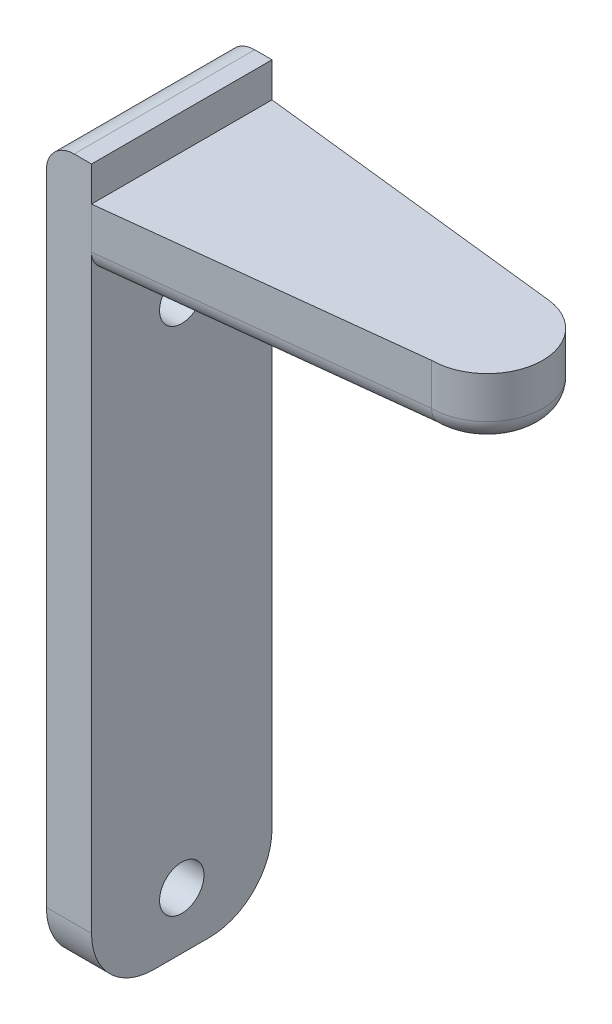
ISO-10303-21;
HEADER;
FILE_DESCRIPTION(('STEP AP214'),'2;1');
FILE_NAME('part.step','',(''),(''),'','','');
FILE_SCHEMA(('AUTOMOTIVE_DESIGN { 1 0 10303 214 1 1 1 1 }'));
ENDSEC;
DATA;
#1=APPLICATION_CONTEXT('core data for automotive mechanical design processes');
#2=APPLICATION_PROTOCOL_DEFINITION('international standard','automotive_design',2000,#1);
#3=PRODUCT_CONTEXT('',#1,'mechanical');
#4=PRODUCT('Part','Part','',(#3));
#5=PRODUCT_RELATED_PRODUCT_CATEGORY('part','',(#4));
#6=PRODUCT_DEFINITION_FORMATION('','',#4);
#7=PRODUCT_DEFINITION_CONTEXT('part definition',#1,'design');
#8=PRODUCT_DEFINITION('design','',#6,#7);
#9=PRODUCT_DEFINITION_SHAPE('','',#8);
#10=(LENGTH_UNIT() NAMED_UNIT(*) SI_UNIT(.MILLI.,.METRE.));
#11=(NAMED_UNIT(*) PLANE_ANGLE_UNIT() SI_UNIT($,.RADIAN.));
#12=(NAMED_UNIT(*) SI_UNIT($,.STERADIAN.) SOLID_ANGLE_UNIT());
#13=UNCERTAINTY_MEASURE_WITH_UNIT(LENGTH_MEASURE(1.E-05),#10,'distance_accuracy_value','');
#14=(GEOMETRIC_REPRESENTATION_CONTEXT(3) GLOBAL_UNCERTAINTY_ASSIGNED_CONTEXT((#13)) GLOBAL_UNIT_ASSIGNED_CONTEXT((#10,
#11,#12)) REPRESENTATION_CONTEXT('',''));
#15=CARTESIAN_POINT('',(0.,0.,0.));
#16=DIRECTION('',(0.,0.,1.));
#17=DIRECTION('',(1.,0.,0.));
#18=AXIS2_PLACEMENT_3D('',#15,#16,#17);
#19=CARTESIAN_POINT('',(0.,0.,13.));
#20=DIRECTION('',(0.,1.,0.));
#21=DIRECTION('',(0.,0.,1.));
#22=AXIS2_PLACEMENT_3D('',#19,#20,#21);
#23=PLANE('',#22);
#24=DIRECTION('',(0.,0.,-1.));
#25=VECTOR('',#24,1.);
#26=CARTESIAN_POINT('',(0.,0.,13.));
#27=LINE('',#26,#25);
#28=CARTESIAN_POINT('',(0.,0.,11.4903461487106));
#29=VERTEX_POINT('',#28);
#30=CARTESIAN_POINT('',(0.,0.,1.50946060186236));
#31=VERTEX_POINT('',#30);
#32=EDGE_CURVE('E203',#29,#31,#27,.T.);
#33=ORIENTED_EDGE('',*,*,#32,.T.);
#34=DIRECTION('',(0.9937324618803,0.,0.11178458840698));
#35=VECTOR('',#34,1.);
#36=CARTESIAN_POINT('',(1.27641478248281,0.,1.65304401748958));
#37=LINE('',#36,#35);
#38=CARTESIAN_POINT('',(22.2794619833277,0.,4.01566884529924));
#39=VERTEX_POINT('',#38);
#40=EDGE_CURVE('E231',#31,#39,#37,.T.);
#41=ORIENTED_EDGE('',*,*,#40,.T.);
#42=CARTESIAN_POINT('',(22.0000005123102,0.,6.5));
#43=DIRECTION('',(0.,1.,0.));
#44=DIRECTION('',(0.,0.,1.));
#45=AXIS2_PLACEMENT_3D('',#42,#43,#44);
#46=CIRCLE('',#45,2.50000000000001);
#47=CARTESIAN_POINT('',(21.9249596445972,0.,8.99887351984308));
#48=VERTEX_POINT('',#47);
#49=EDGE_CURVE('E229',#39,#48,#46,.F.);
#50=ORIENTED_EDGE('',*,*,#49,.T.);
#51=DIRECTION('',(0.993605255084695,0.,-0.112909685448497));
#52=VECTOR('',#51,1.);
#53=CARTESIAN_POINT('',(-0.169364528172745,0.,11.509592117373));
#54=LINE('',#53,#52);
#55=EDGE_CURVE('E227',#48,#29,#54,.F.);
#56=ORIENTED_EDGE('',*,*,#55,.T.);
#57=EDGE_LOOP('',(#33,#41,#50,#56));
#58=FACE_BOUND('',#57,.T.);
#59=ADVANCED_FACE('F33',(#58),#23,.F.);
#60=CARTESIAN_POINT('',(0.,4.5,13.));
#61=DIRECTION('',(0.,-1.,0.));
#62=DIRECTION('',(0.,0.,-1.));
#63=AXIS2_PLACEMENT_3D('',#60,#61,#62);
#64=PLANE('',#63);
#65=DIRECTION('',(0.993605255084695,0.,-0.112909685448497));
#66=VECTOR('',#65,1.);
#67=CARTESIAN_POINT('',(1.45843953855062,4.5,12.834268238115));
#68=LINE('',#67,#66);
#69=CARTESIAN_POINT('',(0.,4.5,13.));
#70=VERTEX_POINT('',#69);
#71=CARTESIAN_POINT('',(22.0000005123102,4.5,10.5));
#72=VERTEX_POINT('',#71);
#73=EDGE_CURVE('E138',#70,#72,#68,.T.);
#74=ORIENTED_EDGE('',*,*,#73,.T.);
#75=CARTESIAN_POINT('',(22.0000005123102,4.5,6.5));
#76=DIRECTION('',(0.,1.,0.));
#77=DIRECTION('',(0.,0.,1.));
#78=AXIS2_PLACEMENT_3D('',#75,#76,#77);
#79=CIRCLE('',#78,4.00000000000001);
#80=CARTESIAN_POINT('',(22.4471388659382,4.5,2.5250701524788));
#81=VERTEX_POINT('',#80);
#82=EDGE_CURVE('E141',#72,#81,#79,.T.);
#83=ORIENTED_EDGE('',*,*,#82,.T.);
#84=DIRECTION('',(0.9937324618803,0.,0.11178458840698));
#85=VECTOR('',#84,1.);
#86=CARTESIAN_POINT('',(0.,4.5,0.));
#87=LINE('',#86,#85);
#88=CARTESIAN_POINT('',(0.,4.5,0.));
#89=VERTEX_POINT('',#88);
#90=EDGE_CURVE('E150',#89,#81,#87,.T.);
#91=ORIENTED_EDGE('',*,*,#90,.F.);
#92=DIRECTION('',(0.,0.,-1.));
#93=VECTOR('',#92,1.);
#94=CARTESIAN_POINT('',(0.,4.5,13.));
#95=LINE('',#94,#93);
#96=EDGE_CURVE('E155',#70,#89,#95,.T.);
#97=ORIENTED_EDGE('',*,*,#96,.F.);
#98=EDGE_LOOP('',(#74,#83,#91,#97));
#99=FACE_BOUND('',#98,.T.);
#100=ADVANCED_FACE('F153',(#99),#64,.F.);
#101=CARTESIAN_POINT('',(-1.25,5.,13.));
#102=DIRECTION('',(0.,0.,-1.));
#103=DIRECTION('',(-1.,0.,0.));
#104=AXIS2_PLACEMENT_3D('',#101,#102,#103);
#105=PLANE('',#104);
#106=DIRECTION('',(0.,-1.,0.));
#107=VECTOR('',#106,1.);
#108=CARTESIAN_POINT('',(0.,5.,13.));
#109=LINE('',#108,#107);
#110=CARTESIAN_POINT('',(0.,1.5,13.));
#111=VERTEX_POINT('',#110);
#112=EDGE_CURVE('E225',#70,#111,#109,.T.);
#113=ORIENTED_EDGE('',*,*,#112,.F.);
#114=DIRECTION('',(0.,1.,0.));
#115=VECTOR('',#114,1.);
#116=CARTESIAN_POINT('',(0.,4.5,13.));
#117=LINE('',#116,#115);
#118=CARTESIAN_POINT('',(0.,7.,13.));
#119=VERTEX_POINT('',#118);
#120=EDGE_CURVE('E168',#70,#119,#117,.T.);
#121=ORIENTED_EDGE('',*,*,#120,.T.);
#122=DIRECTION('',(-1.,0.,0.));
#123=VECTOR('',#122,1.);
#124=CARTESIAN_POINT('',(0.,7.,13.));
#125=LINE('',#124,#123);
#126=CARTESIAN_POINT('',(-1.24999999999999,7.,13.));
#127=VERTEX_POINT('',#126);
#128=EDGE_CURVE('E171',#119,#127,#125,.T.);
#129=ORIENTED_EDGE('',*,*,#128,.T.);
#130=CARTESIAN_POINT('',(-1.25,5.,13.));
#131=DIRECTION('',(0.,0.,1.));
#132=DIRECTION('',(-1.,0.,0.));
#133=AXIS2_PLACEMENT_3D('',#130,#131,#132);
#134=CIRCLE('',#133,2.);
#135=CARTESIAN_POINT('',(-3.25,4.99999999999999,13.));
#136=VERTEX_POINT('',#135);
#137=EDGE_CURVE('E173',#127,#136,#134,.T.);
#138=ORIENTED_EDGE('',*,*,#137,.T.);
#139=DIRECTION('',(0.,-1.,0.));
#140=VECTOR('',#139,1.);
#141=CARTESIAN_POINT('',(-3.25,-45.5,13.));
#142=LINE('',#141,#140);
#143=CARTESIAN_POINT('',(-3.25,-41.,13.));
#144=VERTEX_POINT('',#143);
#145=EDGE_CURVE('E175',#136,#144,#142,.T.);
#146=ORIENTED_EDGE('',*,*,#145,.T.);
#147=DIRECTION('',(1.,0.,0.));
#148=VECTOR('',#147,1.);
#149=CARTESIAN_POINT('',(-1.25,-41.,13.));
#150=LINE('',#149,#148);
#151=CARTESIAN_POINT('',(0.,-41.,13.));
#152=VERTEX_POINT('',#151);
#153=EDGE_CURVE('E206',#144,#152,#150,.T.);
#154=ORIENTED_EDGE('',*,*,#153,.T.);
#155=DIRECTION('',(0.,1.,0.));
#156=VECTOR('',#155,1.);
#157=CARTESIAN_POINT('',(0.,-45.5,13.));
#158=LINE('',#157,#156);
#159=EDGE_CURVE('E55',#152,#111,#158,.T.);
#160=ORIENTED_EDGE('',*,*,#159,.T.);
#161=EDGE_LOOP('',(#113,#121,#129,#138,#146,#154,#160));
#162=FACE_BOUND('',#161,.T.);
#163=ADVANCED_FACE('F283',(#162),#105,.F.);
#164=CARTESIAN_POINT('',(0.,-45.5,13.));
#165=DIRECTION('',(-1.,0.,0.));
#166=DIRECTION('',(0.,0.,1.));
#167=AXIS2_PLACEMENT_3D('',#164,#165,#166);
#168=PLANE('',#167);
#169=CARTESIAN_POINT('',(0.,-4.59999999998963,6.49991314393883));
#170=DIRECTION('',(-1.,0.,0.));
#171=DIRECTION('',(0.,0.,1.));
#172=AXIS2_PLACEMENT_3D('',#169,#170,#171);
#173=CIRCLE('',#172,1.6);
#174=CARTESIAN_POINT('',(0.,-4.59999999998963,4.89991314393883));
#175=VERTEX_POINT('',#174);
#176=EDGE_CURVE('E161',#175,#175,#173,.T.);
#177=ORIENTED_EDGE('',*,*,#176,.T.);
#178=EDGE_LOOP('',(#177));
#179=FACE_BOUND('',#178,.T.);
#180=CARTESIAN_POINT('',(0.,-41.3999999999066,6.49999129315768));
#181=DIRECTION('',(-1.,0.,0.));
#182=DIRECTION('',(0.,0.,1.));
#183=AXIS2_PLACEMENT_3D('',#180,#181,#182);
#184=CIRCLE('',#183,1.6);
#185=CARTESIAN_POINT('',(0.,-41.3999999999066,4.89999129315769));
#186=VERTEX_POINT('',#185);
#187=EDGE_CURVE('E246',#186,#186,#184,.T.);
#188=ORIENTED_EDGE('',*,*,#187,.T.);
#189=EDGE_LOOP('',(#188));
#190=FACE_BOUND('',#189,.T.);
#191=ORIENTED_EDGE('',*,*,#159,.F.);
#192=CARTESIAN_POINT('',(0.,-41.,8.5));
#193=DIRECTION('',(-1.,0.,0.));
#194=DIRECTION('',(0.,0.,1.));
#195=AXIS2_PLACEMENT_3D('',#192,#193,#194);
#196=CIRCLE('',#195,4.5);
#197=CARTESIAN_POINT('',(0.,-45.5,8.5));
#198=VERTEX_POINT('',#197);
#199=EDGE_CURVE('E210',#152,#198,#196,.F.);
#200=ORIENTED_EDGE('',*,*,#199,.T.);
#201=DIRECTION('',(0.,0.,-1.));
#202=VECTOR('',#201,1.);
#203=CARTESIAN_POINT('',(0.,-45.5,13.));
#204=LINE('',#203,#202);
#205=CARTESIAN_POINT('',(0.,-45.5,4.5));
#206=VERTEX_POINT('',#205);
#207=EDGE_CURVE('E178',#198,#206,#204,.T.);
#208=ORIENTED_EDGE('',*,*,#207,.T.);
#209=CARTESIAN_POINT('',(0.,-41.,4.5));
#210=DIRECTION('',(-1.,0.,0.));
#211=DIRECTION('',(0.,0.,1.));
#212=AXIS2_PLACEMENT_3D('',#209,#210,#211);
#213=CIRCLE('',#212,4.5);
#214=CARTESIAN_POINT('',(0.,-41.,0.));
#215=VERTEX_POINT('',#214);
#216=EDGE_CURVE('E208',#206,#215,#213,.F.);
#217=ORIENTED_EDGE('',*,*,#216,.T.);
#218=DIRECTION('',(0.,1.,0.));
#219=VECTOR('',#218,1.);
#220=CARTESIAN_POINT('',(0.,-45.5,0.));
#221=LINE('',#220,#219);
#222=CARTESIAN_POINT('',(0.,1.5,0.));
#223=VERTEX_POINT('',#222);
#224=EDGE_CURVE('E166',#215,#223,#221,.T.);
#225=ORIENTED_EDGE('',*,*,#224,.T.);
#226=CARTESIAN_POINT('',(0.,1.5,1.50946060186235));
#227=DIRECTION('',(-1.,0.,0.));
#228=DIRECTION('',(0.,0.,1.));
#229=AXIS2_PLACEMENT_3D('',#226,#227,#228);
#230=ELLIPSE('',#229,1.50946060186236,1.5);
#231=EDGE_CURVE('E47',#223,#31,#230,.T.);
#232=ORIENTED_EDGE('',*,*,#231,.T.);
#233=ORIENTED_EDGE('',*,*,#32,.F.);
#234=CARTESIAN_POINT('',(0.,1.5,11.4903461487106));
#235=DIRECTION('',(-1.,0.,0.));
#236=DIRECTION('',(0.,0.,1.));
#237=AXIS2_PLACEMENT_3D('',#234,#235,#236);
#238=ELLIPSE('',#237,1.5096538512894,1.5);
#239=EDGE_CURVE('E11',#29,#111,#238,.T.);
#240=ORIENTED_EDGE('',*,*,#239,.T.);
#241=EDGE_LOOP('',(#191,#200,#208,#217,#225,#232,#233,#240));
#242=FACE_BOUND('',#241,.T.);
#243=ADVANCED_FACE('F287',(#179,#190,#242),#168,.F.);
#244=CARTESIAN_POINT('',(0.,4.5,13.));
#245=DIRECTION('',(-1.,0.,0.));
#246=DIRECTION('',(0.,0.,1.));
#247=AXIS2_PLACEMENT_3D('',#244,#245,#246);
#248=PLANE('',#247);
#249=DIRECTION('',(0.,1.,0.));
#250=VECTOR('',#249,1.);
#251=CARTESIAN_POINT('',(0.,4.5,0.));
#252=LINE('',#251,#250);
#253=CARTESIAN_POINT('',(0.,7.,0.));
#254=VERTEX_POINT('',#253);
#255=EDGE_CURVE('E180',#89,#254,#252,.T.);
#256=ORIENTED_EDGE('',*,*,#255,.T.);
#257=DIRECTION('',(0.,0.,-1.));
#258=VECTOR('',#257,1.);
#259=CARTESIAN_POINT('',(0.,7.,13.));
#260=LINE('',#259,#258);
#261=EDGE_CURVE('E199',#119,#254,#260,.T.);
#262=ORIENTED_EDGE('',*,*,#261,.F.);
#263=ORIENTED_EDGE('',*,*,#120,.F.);
#264=ORIENTED_EDGE('',*,*,#96,.T.);
#265=EDGE_LOOP('',(#256,#262,#263,#264));
#266=FACE_BOUND('',#265,.T.);
#267=ADVANCED_FACE('F290',(#266),#248,.F.);
#268=CARTESIAN_POINT('',(0.,7.,13.));
#269=DIRECTION('',(0.,-1.,0.));
#270=DIRECTION('',(0.,0.,-1.));
#271=AXIS2_PLACEMENT_3D('',#268,#269,#270);
#272=PLANE('',#271);
#273=DIRECTION('',(-1.,0.,0.));
#274=VECTOR('',#273,1.);
#275=CARTESIAN_POINT('',(0.,7.,0.));
#276=LINE('',#275,#274);
#277=CARTESIAN_POINT('',(-1.24999999999999,7.,0.));
#278=VERTEX_POINT('',#277);
#279=EDGE_CURVE('E182',#254,#278,#276,.T.);
#280=ORIENTED_EDGE('',*,*,#279,.T.);
#281=DIRECTION('',(0.,0.,-1.));
#282=VECTOR('',#281,1.);
#283=CARTESIAN_POINT('',(-1.24999999999999,7.,13.));
#284=LINE('',#283,#282);
#285=EDGE_CURVE('E196',#127,#278,#284,.T.);
#286=ORIENTED_EDGE('',*,*,#285,.F.);
#287=ORIENTED_EDGE('',*,*,#128,.F.);
#288=ORIENTED_EDGE('',*,*,#261,.T.);
#289=EDGE_LOOP('',(#280,#286,#287,#288));
#290=FACE_BOUND('',#289,.T.);
#291=ADVANCED_FACE('F320',(#290),#272,.F.);
#292=CARTESIAN_POINT('',(-1.25,5.,13.));
#293=DIRECTION('',(0.,0.,-1.));
#294=DIRECTION('',(-1.,0.,0.));
#295=AXIS2_PLACEMENT_3D('',#292,#293,#294);
#296=CYLINDRICAL_SURFACE('',#295,2.);
#297=CARTESIAN_POINT('',(-1.25,5.,0.));
#298=DIRECTION('',(0.,0.,1.));
#299=DIRECTION('',(-1.,0.,0.));
#300=AXIS2_PLACEMENT_3D('',#297,#298,#299);
#301=CIRCLE('',#300,2.);
#302=CARTESIAN_POINT('',(-3.25,4.99999999999999,0.));
#303=VERTEX_POINT('',#302);
#304=EDGE_CURVE('E184',#278,#303,#301,.T.);
#305=ORIENTED_EDGE('',*,*,#304,.T.);
#306=DIRECTION('',(0.,0.,-1.));
#307=VECTOR('',#306,1.);
#308=CARTESIAN_POINT('',(-3.25,4.99999999999999,13.));
#309=LINE('',#308,#307);
#310=EDGE_CURVE('E193',#136,#303,#309,.T.);
#311=ORIENTED_EDGE('',*,*,#310,.F.);
#312=ORIENTED_EDGE('',*,*,#137,.F.);
#313=ORIENTED_EDGE('',*,*,#285,.T.);
#314=EDGE_LOOP('',(#305,#311,#312,#313));
#315=FACE_BOUND('',#314,.T.);
#316=ADVANCED_FACE('F325',(#315),#296,.T.);
#317=CARTESIAN_POINT('',(-3.25,-45.5,13.));
#318=DIRECTION('',(1.,0.,0.));
#319=DIRECTION('',(0.,0.,-1.));
#320=AXIS2_PLACEMENT_3D('',#317,#318,#319);
#321=PLANE('',#320);
#322=CARTESIAN_POINT('',(-3.25,-4.59999999998963,6.49991314393883));
#323=DIRECTION('',(1.,0.,0.));
#324=DIRECTION('',(0.,0.,-1.));
#325=AXIS2_PLACEMENT_3D('',#322,#323,#324);
#326=CIRCLE('',#325,1.6);
#327=CARTESIAN_POINT('',(-3.25,-4.59999999998963,4.89991314393883));
#328=VERTEX_POINT('',#327);
#329=EDGE_CURVE('E250',#328,#328,#326,.T.);
#330=ORIENTED_EDGE('',*,*,#329,.T.);
#331=EDGE_LOOP('',(#330));
#332=FACE_BOUND('',#331,.T.);
#333=CARTESIAN_POINT('',(-3.25,-41.3999999999066,6.49999129315768));
#334=DIRECTION('',(1.,0.,0.));
#335=DIRECTION('',(0.,0.,-1.));
#336=AXIS2_PLACEMENT_3D('',#333,#334,#335);
#337=CIRCLE('',#336,1.6);
#338=CARTESIAN_POINT('',(-3.25,-41.3999999999066,4.89999129315769));
#339=VERTEX_POINT('',#338);
#340=EDGE_CURVE('E254',#339,#339,#337,.T.);
#341=ORIENTED_EDGE('',*,*,#340,.T.);
#342=EDGE_LOOP('',(#341));
#343=FACE_BOUND('',#342,.T.);
#344=DIRECTION('',(0.,0.,-1.));
#345=VECTOR('',#344,1.);
#346=CARTESIAN_POINT('',(-3.25,-45.5,13.));
#347=LINE('',#346,#345);
#348=CARTESIAN_POINT('',(-3.25,-45.5,8.5));
#349=VERTEX_POINT('',#348);
#350=CARTESIAN_POINT('',(-3.25,-45.5,4.5));
#351=VERTEX_POINT('',#350);
#352=EDGE_CURVE('E190',#349,#351,#347,.T.);
#353=ORIENTED_EDGE('',*,*,#352,.F.);
#354=CARTESIAN_POINT('',(-3.25,-41.,8.5));
#355=DIRECTION('',(1.,0.,0.));
#356=DIRECTION('',(0.,0.,-1.));
#357=AXIS2_PLACEMENT_3D('',#354,#355,#356);
#358=CIRCLE('',#357,4.5);
#359=EDGE_CURVE('E219',#349,#144,#358,.F.);
#360=ORIENTED_EDGE('',*,*,#359,.T.);
#361=ORIENTED_EDGE('',*,*,#145,.F.);
#362=ORIENTED_EDGE('',*,*,#310,.T.);
#363=DIRECTION('',(0.,-1.,0.));
#364=VECTOR('',#363,1.);
#365=CARTESIAN_POINT('',(-3.25,-45.5,0.));
#366=LINE('',#365,#364);
#367=CARTESIAN_POINT('',(-3.25,-41.,0.));
#368=VERTEX_POINT('',#367);
#369=EDGE_CURVE('E169',#303,#368,#366,.T.);
#370=ORIENTED_EDGE('',*,*,#369,.T.);
#371=CARTESIAN_POINT('',(-3.25,-41.,4.5));
#372=DIRECTION('',(1.,0.,0.));
#373=DIRECTION('',(0.,0.,-1.));
#374=AXIS2_PLACEMENT_3D('',#371,#372,#373);
#375=CIRCLE('',#374,4.5);
#376=EDGE_CURVE('E217',#368,#351,#375,.F.);
#377=ORIENTED_EDGE('',*,*,#376,.T.);
#378=EDGE_LOOP('',(#353,#360,#361,#362,#370,#377));
#379=FACE_BOUND('',#378,.T.);
#380=ADVANCED_FACE('F260',(#332,#343,#379),#321,.F.);
#381=CARTESIAN_POINT('',(0.,-45.5,13.));
#382=DIRECTION('',(0.,1.,0.));
#383=DIRECTION('',(0.,0.,1.));
#384=AXIS2_PLACEMENT_3D('',#381,#382,#383);
#385=PLANE('',#384);
#386=ORIENTED_EDGE('',*,*,#207,.F.);
#387=DIRECTION('',(1.,0.,0.));
#388=VECTOR('',#387,1.);
#389=CARTESIAN_POINT('',(0.,-45.5,8.5));
#390=LINE('',#389,#388);
#391=EDGE_CURVE('E215',#198,#349,#390,.F.);
#392=ORIENTED_EDGE('',*,*,#391,.T.);
#393=ORIENTED_EDGE('',*,*,#352,.T.);
#394=DIRECTION('',(1.,0.,0.));
#395=VECTOR('',#394,1.);
#396=CARTESIAN_POINT('',(0.,-45.5,4.5));
#397=LINE('',#396,#395);
#398=EDGE_CURVE('E212',#351,#206,#397,.T.);
#399=ORIENTED_EDGE('',*,*,#398,.T.);
#400=EDGE_LOOP('',(#386,#392,#393,#399));
#401=FACE_BOUND('',#400,.T.);
#402=ADVANCED_FACE('F332',(#401),#385,.F.);
#403=CARTESIAN_POINT('',(-1.25,5.,0.));
#404=DIRECTION('',(0.,0.,-1.));
#405=DIRECTION('',(-1.,0.,0.));
#406=AXIS2_PLACEMENT_3D('',#403,#404,#405);
#407=PLANE('',#406);
#408=DIRECTION('',(0.,1.,0.));
#409=VECTOR('',#408,1.);
#410=CARTESIAN_POINT('',(0.,5.,0.));
#411=LINE('',#410,#409);
#412=EDGE_CURVE('E223',#223,#89,#411,.T.);
#413=ORIENTED_EDGE('',*,*,#412,.F.);
#414=ORIENTED_EDGE('',*,*,#224,.F.);
#415=DIRECTION('',(1.,0.,0.));
#416=VECTOR('',#415,1.);
#417=CARTESIAN_POINT('',(-3.25,-41.,0.));
#418=LINE('',#417,#416);
#419=EDGE_CURVE('E221',#215,#368,#418,.F.);
#420=ORIENTED_EDGE('',*,*,#419,.T.);
#421=ORIENTED_EDGE('',*,*,#369,.F.);
#422=ORIENTED_EDGE('',*,*,#304,.F.);
#423=ORIENTED_EDGE('',*,*,#279,.F.);
#424=ORIENTED_EDGE('',*,*,#255,.F.);
#425=EDGE_LOOP('',(#413,#414,#420,#421,#422,#423,#424));
#426=FACE_BOUND('',#425,.T.);
#427=ADVANCED_FACE('F295',(#426),#407,.T.);
#428=CARTESIAN_POINT('',(-1.25,-41.,8.5));
#429=DIRECTION('',(1.,0.,0.));
#430=DIRECTION('',(0.,0.,-1.));
#431=AXIS2_PLACEMENT_3D('',#428,#429,#430);
#432=CYLINDRICAL_SURFACE('',#431,4.5);
#433=ORIENTED_EDGE('',*,*,#359,.F.);
#434=ORIENTED_EDGE('',*,*,#391,.F.);
#435=ORIENTED_EDGE('',*,*,#199,.F.);
#436=ORIENTED_EDGE('',*,*,#153,.F.);
#437=EDGE_LOOP('',(#433,#434,#435,#436));
#438=FACE_BOUND('',#437,.T.);
#439=ADVANCED_FACE('F291',(#438),#432,.T.);
#440=CARTESIAN_POINT('',(0.,-41.,4.5));
#441=DIRECTION('',(-1.,0.,0.));
#442=DIRECTION('',(0.,0.,1.));
#443=AXIS2_PLACEMENT_3D('',#440,#441,#442);
#444=CYLINDRICAL_SURFACE('',#443,4.5);
#445=ORIENTED_EDGE('',*,*,#376,.F.);
#446=ORIENTED_EDGE('',*,*,#419,.F.);
#447=ORIENTED_EDGE('',*,*,#216,.F.);
#448=ORIENTED_EDGE('',*,*,#398,.F.);
#449=EDGE_LOOP('',(#445,#446,#447,#448));
#450=FACE_BOUND('',#449,.T.);
#451=ADVANCED_FACE('F294',(#450),#444,.T.);
#452=CARTESIAN_POINT('',(22.0000005123102,-8.5,6.5));
#453=DIRECTION('',(0.,1.,0.));
#454=DIRECTION('',(0.,0.,1.));
#455=AXIS2_PLACEMENT_3D('',#452,#453,#454);
#456=CYLINDRICAL_SURFACE('',#455,4.00000000000001);
#457=DIRECTION('',(0.,1.,0.));
#458=VECTOR('',#457,1.);
#459=CARTESIAN_POINT('',(22.0000005123102,-8.5,10.5));
#460=LINE('',#459,#458);
#461=CARTESIAN_POINT('',(22.0000005123102,1.5,10.5));
#462=VERTEX_POINT('',#461);
#463=EDGE_CURVE('E134',#462,#72,#460,.T.);
#464=ORIENTED_EDGE('',*,*,#463,.F.);
#465=CARTESIAN_POINT('',(22.0000005123102,1.5,6.5));
#466=DIRECTION('',(0.,1.,0.));
#467=DIRECTION('',(0.,0.,1.));
#468=AXIS2_PLACEMENT_3D('',#465,#466,#467);
#469=CIRCLE('',#468,4.00000000000001);
#470=CARTESIAN_POINT('',(22.4471388659382,1.5,2.5250701524788));
#471=VERTEX_POINT('',#470);
#472=EDGE_CURVE('E237',#462,#471,#469,.T.);
#473=ORIENTED_EDGE('',*,*,#472,.T.);
#474=DIRECTION('',(0.,1.,0.));
#475=VECTOR('',#474,1.);
#476=CARTESIAN_POINT('',(22.4471388659382,-8.5,2.5250701524788));
#477=LINE('',#476,#475);
#478=EDGE_CURVE('E146',#471,#81,#477,.T.);
#479=ORIENTED_EDGE('',*,*,#478,.T.);
#480=ORIENTED_EDGE('',*,*,#82,.F.);
#481=EDGE_LOOP('',(#464,#473,#479,#480));
#482=FACE_BOUND('',#481,.T.);
#483=ADVANCED_FACE('F144',(#482),#456,.T.);
#484=CARTESIAN_POINT('',(0.,-8.5,0.));
#485=DIRECTION('',(-0.11178458840698,0.,0.9937324618803));
#486=DIRECTION('',(0.9937324618803,0.,0.11178458840698));
#487=AXIS2_PLACEMENT_3D('',#484,#485,#486);
#488=PLANE('',#487);
#489=ORIENTED_EDGE('',*,*,#478,.F.);
#490=DIRECTION('',(0.9937324618803,0.,0.11178458840698));
#491=VECTOR('',#490,1.);
#492=CARTESIAN_POINT('',(0.,1.5,0.));
#493=LINE('',#492,#491);
#494=EDGE_CURVE('E234',#471,#223,#493,.F.);
#495=ORIENTED_EDGE('',*,*,#494,.T.);
#496=ORIENTED_EDGE('',*,*,#412,.T.);
#497=ORIENTED_EDGE('',*,*,#90,.T.);
#498=EDGE_LOOP('',(#489,#495,#496,#497));
#499=FACE_BOUND('',#498,.T.);
#500=ADVANCED_FACE('F308',(#499),#488,.F.);
#501=CARTESIAN_POINT('',(1.45843953855062,-8.5,12.834268238115));
#502=DIRECTION('',(0.112909685448497,0.,0.993605255084695));
#503=DIRECTION('',(0.993605255084695,0.,-0.112909685448497));
#504=AXIS2_PLACEMENT_3D('',#501,#502,#503);
#505=PLANE('',#504);
#506=ORIENTED_EDGE('',*,*,#112,.T.);
#507=DIRECTION('',(0.993605255084695,0.,-0.112909685448497));
#508=VECTOR('',#507,1.);
#509=CARTESIAN_POINT('',(22.0000005123102,1.5,10.5));
#510=LINE('',#509,#508);
#511=EDGE_CURVE('E62',#111,#462,#510,.T.);
#512=ORIENTED_EDGE('',*,*,#511,.T.);
#513=ORIENTED_EDGE('',*,*,#463,.T.);
#514=ORIENTED_EDGE('',*,*,#73,.F.);
#515=EDGE_LOOP('',(#506,#512,#513,#514));
#516=FACE_BOUND('',#515,.T.);
#517=ADVANCED_FACE('F136',(#516),#505,.T.);
#518=CARTESIAN_POINT('',(1.28907501037787,1.5,11.3438603554879));
#519=DIRECTION('',(-0.993605255084695,0.,0.112909685448497));
#520=DIRECTION('',(0.112909685448497,0.,0.993605255084695));
#521=AXIS2_PLACEMENT_3D('',#518,#519,#520);
#522=CYLINDRICAL_SURFACE('',#521,1.5);
#523=ORIENTED_EDGE('',*,*,#239,.F.);
#524=ORIENTED_EDGE('',*,*,#55,.F.);
#525=CARTESIAN_POINT('',(22.0000005123102,1.5,10.5));
#526=CARTESIAN_POINT('',(22.0000006063896,1.45785126515681,10.499999741614));
#527=CARTESIAN_POINT('',(21.9998998220329,1.41572273797724,10.4982223672644));
#528=CARTESIAN_POINT('',(21.9994984703033,1.33176743973494,10.4911318528883));
#529=CARTESIAN_POINT('',(21.9991979130162,1.28994065354623,10.4858188913599));
#530=CARTESIAN_POINT('',(21.9980008226168,1.16543325084489,10.4646269910921));
#531=CARTESIAN_POINT('',(21.9968088574595,1.08358719560377,10.4434948981213));
#532=CARTESIAN_POINT('',(21.9936891761655,0.92461384348526,10.387812605944));
#533=CARTESIAN_POINT('',(21.9917611191533,0.847488752059123,10.353256189963));
#534=CARTESIAN_POINT('',(21.9872556147017,0.700145192725482,10.2717164293582));
#535=CARTESIAN_POINT('',(21.9846783131447,0.629925178198718,10.2247358762661));
#536=CARTESIAN_POINT('',(21.9789876141044,0.498332727269036,10.1196531911469));
#537=CARTESIAN_POINT('',(21.9758739126145,0.436965344564421,10.0615447502532));
#538=CARTESIAN_POINT('',(21.9692495236282,0.324832094629854,9.93585095945051));
#539=CARTESIAN_POINT('',(21.965738705274,0.274069737739912,9.86826248391578));
#540=CARTESIAN_POINT('',(21.9584721629963,0.184519109249092,9.72542534280304));
#541=CARTESIAN_POINT('',(21.9547160155852,0.145752243282793,9.65016329840086));
#542=CARTESIAN_POINT('',(21.9471338230303,0.0814223537390013,9.49423371838559));
#543=CARTESIAN_POINT('',(21.9433078389189,0.0558483235380033,9.41357075238709));
#544=CARTESIAN_POINT('',(21.9371810406901,0.0255979722300569,9.28018440335453));
#545=CARTESIAN_POINT('',(21.9348485484126,0.0166785908306173,9.22838091933205));
#546=CARTESIAN_POINT('',(21.9302629163546,0.00431074096734852,9.12417306370493));
#547=CARTESIAN_POINT('',(21.9280096581074,0.000853732900430264,9.07176975929344));
#548=CARTESIAN_POINT('',(21.9255287031286,4.63803998134102E-05,9.01253238190239));
#549=CARTESIAN_POINT('',(21.9252436556857,-1.22505343423889E-07,9.00570261649321));
#550=CARTESIAN_POINT('',(21.9249596445972,0.,8.99887351984308));
#551=B_SPLINE_CURVE_WITH_KNOTS('',3,(#525,#526,#527,#528,#529,#530,#531,#532,#533,#534,#535,
#536,#537,#538,#539,#540,#541,#542,#543,#544,#545,#546,#547,#548,#549,#550),.UNSPECIFIED.,.F.,
.F.,(4,2,2,2,2,2,2,2,2,2,2,2,4),(0.,0.126368489270392,0.252730599171948,0.505044922884626,
0.757476232364199,1.00985087213867,1.26236901956352,1.51497062034397,1.76802041646794,
2.02085875337985,2.17846496595002,2.3358245401465,2.35633140354627),.UNSPECIFIED.);
#552=EDGE_CURVE('E38',#462,#48,#551,.T.);
#553=ORIENTED_EDGE('',*,*,#552,.F.);
#554=ORIENTED_EDGE('',*,*,#511,.F.);
#555=EDGE_LOOP('',(#523,#524,#553,#554));
#556=FACE_BOUND('',#555,.T.);
#557=ADVANCED_FACE('F299',(#556),#522,.T.);
#558=CARTESIAN_POINT('',(22.0000005123102,1.5,6.5));
#559=DIRECTION('',(0.,1.,0.));
#560=DIRECTION('',(0.,0.,1.));
#561=AXIS2_PLACEMENT_3D('',#558,#559,#560);
#562=TOROIDAL_SURFACE('',#561,2.50000000000001,1.5);
#563=ORIENTED_EDGE('',*,*,#552,.T.);
#564=ORIENTED_EDGE('',*,*,#49,.F.);
#565=CARTESIAN_POINT('',(22.2794619833277,1.5,4.01566884529924));
#566=DIRECTION('',(-0.9937324618803,0.,-0.11178458840698));
#567=DIRECTION('',(-0.11178458840698,0.,0.9937324618803));
#568=AXIS2_PLACEMENT_3D('',#565,#566,#567);
#569=CIRCLE('',#568,1.5);
#570=EDGE_CURVE('E159',#471,#39,#569,.T.);
#571=ORIENTED_EDGE('',*,*,#570,.F.);
#572=ORIENTED_EDGE('',*,*,#472,.F.);
#573=EDGE_LOOP('',(#563,#564,#571,#572));
#574=FACE_BOUND('',#573,.T.);
#575=ADVANCED_FACE('F35',(#574),#562,.T.);
#576=CARTESIAN_POINT('',(1.27641478248281,1.5,1.65304401748958));
#577=DIRECTION('',(0.9937324618803,0.,0.11178458840698));
#578=DIRECTION('',(0.11178458840698,0.,-0.9937324618803));
#579=AXIS2_PLACEMENT_3D('',#576,#577,#578);
#580=CYLINDRICAL_SURFACE('',#579,1.5);
#581=ORIENTED_EDGE('',*,*,#231,.F.);
#582=ORIENTED_EDGE('',*,*,#494,.F.);
#583=ORIENTED_EDGE('',*,*,#570,.T.);
#584=ORIENTED_EDGE('',*,*,#40,.F.);
#585=EDGE_LOOP('',(#581,#582,#583,#584));
#586=FACE_BOUND('',#585,.T.);
#587=ADVANCED_FACE('F267',(#586),#580,.T.);
#588=CARTESIAN_POINT('',(-3.25,-41.3999999999066,6.49999129315768));
#589=DIRECTION('',(1.,0.,0.));
#590=DIRECTION('',(0.,0.,-1.));
#591=AXIS2_PLACEMENT_3D('',#588,#589,#590);
#592=CYLINDRICAL_SURFACE('',#591,1.6);
#593=CARTESIAN_POINT('',(-3.25,-41.3999999999066,4.89999129315769));
#594=CARTESIAN_POINT('',(-3.21614583333333,-41.3999999999066,4.89999129315769));
#595=CARTESIAN_POINT('',(-3.18229166666667,-41.3999999999066,4.89999129315769));
#596=CARTESIAN_POINT('',(-3.11458333333333,-41.3999999999066,4.89999129315769));
#597=CARTESIAN_POINT('',(-3.08072916666667,-41.3999999999066,4.89999129315769));
#598=CARTESIAN_POINT('',(-3.01302083333333,-41.3999999999066,4.89999129315769));
#599=CARTESIAN_POINT('',(-2.97916666666667,-41.3999999999066,4.89999129315769));
#600=CARTESIAN_POINT('',(-2.91145833333333,-41.3999999999066,4.89999129315769));
#601=CARTESIAN_POINT('',(-2.87760416666667,-41.3999999999066,4.89999129315769));
#602=CARTESIAN_POINT('',(-2.80989583333333,-41.3999999999066,4.89999129315769));
#603=CARTESIAN_POINT('',(-2.77604166666667,-41.3999999999066,4.89999129315769));
#604=CARTESIAN_POINT('',(-2.70833333333333,-41.3999999999066,4.89999129315769));
#605=CARTESIAN_POINT('',(-2.67447916666667,-41.3999999999066,4.89999129315769));
#606=CARTESIAN_POINT('',(-2.60677083333333,-41.3999999999066,4.89999129315769));
#607=CARTESIAN_POINT('',(-2.57291666666667,-41.3999999999066,4.89999129315769));
#608=CARTESIAN_POINT('',(-2.50520833333333,-41.3999999999066,4.89999129315769));
#609=CARTESIAN_POINT('',(-2.47135416666667,-41.3999999999066,4.89999129315769));
#610=CARTESIAN_POINT('',(-2.40364583333333,-41.3999999999066,4.89999129315769));
#611=CARTESIAN_POINT('',(-2.36979166666667,-41.3999999999066,4.89999129315769));
#612=CARTESIAN_POINT('',(-2.30208333333333,-41.3999999999066,4.89999129315769));
#613=CARTESIAN_POINT('',(-2.26822916666667,-41.3999999999066,4.89999129315769));
#614=CARTESIAN_POINT('',(-2.20052083333333,-41.3999999999066,4.89999129315769));
#615=CARTESIAN_POINT('',(-2.16666666666667,-41.3999999999066,4.89999129315769));
#616=CARTESIAN_POINT('',(-2.09895833333333,-41.3999999999066,4.89999129315769));
#617=CARTESIAN_POINT('',(-2.06510416666667,-41.3999999999066,4.89999129315769));
#618=CARTESIAN_POINT('',(-1.99739583333333,-41.3999999999066,4.89999129315769));
#619=CARTESIAN_POINT('',(-1.96354166666667,-41.3999999999066,4.89999129315769));
#620=CARTESIAN_POINT('',(-1.89583333333333,-41.3999999999066,4.89999129315769));
#621=CARTESIAN_POINT('',(-1.86197916666667,-41.3999999999066,4.89999129315769));
#622=CARTESIAN_POINT('',(-1.79427083333333,-41.3999999999066,4.89999129315769));
#623=CARTESIAN_POINT('',(-1.76041666666667,-41.3999999999066,4.89999129315769));
#624=CARTESIAN_POINT('',(-1.69270833333333,-41.3999999999066,4.89999129315769));
#625=CARTESIAN_POINT('',(-1.65885416666667,-41.3999999999066,4.89999129315769));
#626=CARTESIAN_POINT('',(-1.59114583333333,-41.3999999999066,4.89999129315769));
#627=CARTESIAN_POINT('',(-1.55729166666667,-41.3999999999066,4.89999129315769));
#628=CARTESIAN_POINT('',(-1.48958333333333,-41.3999999999066,4.89999129315769));
#629=CARTESIAN_POINT('',(-1.45572916666667,-41.3999999999066,4.89999129315769));
#630=CARTESIAN_POINT('',(-1.38802083333333,-41.3999999999066,4.89999129315769));
#631=CARTESIAN_POINT('',(-1.35416666666667,-41.3999999999066,4.89999129315769));
#632=CARTESIAN_POINT('',(-1.28645833333333,-41.3999999999066,4.89999129315769));
#633=CARTESIAN_POINT('',(-1.25260416666667,-41.3999999999066,4.89999129315769));
#634=CARTESIAN_POINT('',(-1.18489583333333,-41.3999999999066,4.89999129315769));
#635=CARTESIAN_POINT('',(-1.15104166666667,-41.3999999999066,4.89999129315769));
#636=CARTESIAN_POINT('',(-1.08333333333333,-41.3999999999066,4.89999129315769));
#637=CARTESIAN_POINT('',(-1.04947916666667,-41.3999999999066,4.89999129315769));
#638=CARTESIAN_POINT('',(-0.981770833333333,-41.3999999999066,4.89999129315769));
#639=CARTESIAN_POINT('',(-0.947916666666667,-41.3999999999066,4.89999129315769));
#640=CARTESIAN_POINT('',(-0.880208333333334,-41.3999999999066,4.89999129315769));
#641=CARTESIAN_POINT('',(-0.846354166666667,-41.3999999999066,4.89999129315769));
#642=CARTESIAN_POINT('',(-0.778645833333334,-41.3999999999066,4.89999129315769));
#643=CARTESIAN_POINT('',(-0.744791666666667,-41.3999999999066,4.89999129315769));
#644=CARTESIAN_POINT('',(-0.677083333333333,-41.3999999999066,4.89999129315769));
#645=CARTESIAN_POINT('',(-0.643229166666667,-41.3999999999066,4.89999129315769));
#646=CARTESIAN_POINT('',(-0.575520833333333,-41.3999999999066,4.89999129315769));
#647=CARTESIAN_POINT('',(-0.541666666666667,-41.3999999999066,4.89999129315769));
#648=CARTESIAN_POINT('',(-0.473958333333333,-41.3999999999066,4.89999129315769));
#649=CARTESIAN_POINT('',(-0.440104166666667,-41.3999999999066,4.89999129315769));
#650=CARTESIAN_POINT('',(-0.372395833333333,-41.3999999999066,4.89999129315769));
#651=CARTESIAN_POINT('',(-0.338541666666667,-41.3999999999066,4.89999129315769));
#652=CARTESIAN_POINT('',(-0.270833333333334,-41.3999999999066,4.89999129315769));
#653=CARTESIAN_POINT('',(-0.236979166666667,-41.3999999999066,4.89999129315769));
#654=CARTESIAN_POINT('',(-0.169270833333334,-41.3999999999066,4.89999129315769));
#655=CARTESIAN_POINT('',(-0.135416666666667,-41.3999999999066,4.89999129315769));
#656=CARTESIAN_POINT('',(-0.0677083333333334,-41.3999999999066,4.89999129315769));
#657=CARTESIAN_POINT('',(-0.0338541666666667,-41.3999999999066,4.89999129315769));
#658=CARTESIAN_POINT('',(0.,-41.3999999999066,4.89999129315769));
#659=B_SPLINE_CURVE_WITH_KNOTS('',3,(#593,#594,#595,#596,#597,#598,#599,#600,#601,#602,#603,
#604,#605,#606,#607,#608,#609,#610,#611,#612,#613,#614,#615,#616,#617,#618,#619,#620,#621,#622,
#623,#624,#625,#626,#627,#628,#629,#630,#631,#632,#633,#634,#635,#636,#637,#638,#639,#640,#641,
#642,#643,#644,#645,#646,#647,#648,#649,#650,#651,#652,#653,#654,#655,#656,#657,#658),
.UNSPECIFIED.,.F.,.F.,(4,2,2,2,2,2,2,2,2,2,2,2,2,2,2,2,2,2,2,2,2,2,2,2,2,2,2,2,2,2,2,2,4),(0.,
0.1015625,0.203125,0.3046875,0.40625,0.5078125,0.609375,0.7109375,0.8125,0.9140625,1.015625,
1.1171875,1.21875,1.3203125,1.421875,1.5234375,1.625,1.7265625,1.828125,1.9296875,2.03125,
2.1328125,2.234375,2.3359375,2.4375,2.5390625,2.640625,2.7421875,2.84375,2.9453125,3.046875,
3.1484375,3.25),.UNSPECIFIED.);
#660=EDGE_CURVE('BSEAM263',#339,#186,#659,.T.);
#661=ORIENTED_EDGE('',*,*,#340,.F.);
#662=ORIENTED_EDGE('',*,*,#187,.F.);
#663=ORIENTED_EDGE('',*,*,#660,.T.);
#664=ORIENTED_EDGE('',*,*,#660,.F.);
#665=EDGE_LOOP('',(#661,#663,#662,#664));
#666=FACE_BOUND('',#665,.T.);
#667=ADVANCED_FACE('F263',(#666),#592,.F.);
#668=CARTESIAN_POINT('',(-3.25,-4.59999999998963,6.49991314393883));
#669=DIRECTION('',(1.,0.,0.));
#670=DIRECTION('',(0.,0.,-1.));
#671=AXIS2_PLACEMENT_3D('',#668,#669,#670);
#672=CYLINDRICAL_SURFACE('',#671,1.6);
#673=CARTESIAN_POINT('',(-3.25,-4.59999999998963,4.89991314393883));
#674=CARTESIAN_POINT('',(-3.21614583333333,-4.59999999998963,4.89991314393883));
#675=CARTESIAN_POINT('',(-3.18229166666667,-4.59999999998963,4.89991314393883));
#676=CARTESIAN_POINT('',(-3.11458333333333,-4.59999999998963,4.89991314393883));
#677=CARTESIAN_POINT('',(-3.08072916666667,-4.59999999998963,4.89991314393883));
#678=CARTESIAN_POINT('',(-3.01302083333333,-4.59999999998963,4.89991314393883));
#679=CARTESIAN_POINT('',(-2.97916666666667,-4.59999999998963,4.89991314393883));
#680=CARTESIAN_POINT('',(-2.91145833333333,-4.59999999998963,4.89991314393883));
#681=CARTESIAN_POINT('',(-2.87760416666667,-4.59999999998963,4.89991314393883));
#682=CARTESIAN_POINT('',(-2.80989583333333,-4.59999999998963,4.89991314393883));
#683=CARTESIAN_POINT('',(-2.77604166666667,-4.59999999998963,4.89991314393883));
#684=CARTESIAN_POINT('',(-2.70833333333333,-4.59999999998963,4.89991314393883));
#685=CARTESIAN_POINT('',(-2.67447916666667,-4.59999999998963,4.89991314393883));
#686=CARTESIAN_POINT('',(-2.60677083333333,-4.59999999998963,4.89991314393883));
#687=CARTESIAN_POINT('',(-2.57291666666667,-4.59999999998963,4.89991314393883));
#688=CARTESIAN_POINT('',(-2.50520833333333,-4.59999999998963,4.89991314393883));
#689=CARTESIAN_POINT('',(-2.47135416666667,-4.59999999998963,4.89991314393883));
#690=CARTESIAN_POINT('',(-2.40364583333333,-4.59999999998963,4.89991314393883));
#691=CARTESIAN_POINT('',(-2.36979166666667,-4.59999999998963,4.89991314393883));
#692=CARTESIAN_POINT('',(-2.30208333333333,-4.59999999998963,4.89991314393883));
#693=CARTESIAN_POINT('',(-2.26822916666667,-4.59999999998963,4.89991314393883));
#694=CARTESIAN_POINT('',(-2.20052083333333,-4.59999999998963,4.89991314393883));
#695=CARTESIAN_POINT('',(-2.16666666666667,-4.59999999998963,4.89991314393883));
#696=CARTESIAN_POINT('',(-2.09895833333333,-4.59999999998963,4.89991314393883));
#697=CARTESIAN_POINT('',(-2.06510416666667,-4.59999999998963,4.89991314393883));
#698=CARTESIAN_POINT('',(-1.99739583333333,-4.59999999998963,4.89991314393883));
#699=CARTESIAN_POINT('',(-1.96354166666667,-4.59999999998963,4.89991314393883));
#700=CARTESIAN_POINT('',(-1.89583333333333,-4.59999999998963,4.89991314393883));
#701=CARTESIAN_POINT('',(-1.86197916666667,-4.59999999998963,4.89991314393883));
#702=CARTESIAN_POINT('',(-1.79427083333333,-4.59999999998963,4.89991314393883));
#703=CARTESIAN_POINT('',(-1.76041666666667,-4.59999999998963,4.89991314393883));
#704=CARTESIAN_POINT('',(-1.69270833333333,-4.59999999998963,4.89991314393883));
#705=CARTESIAN_POINT('',(-1.65885416666667,-4.59999999998963,4.89991314393883));
#706=CARTESIAN_POINT('',(-1.59114583333333,-4.59999999998963,4.89991314393883));
#707=CARTESIAN_POINT('',(-1.55729166666667,-4.59999999998963,4.89991314393883));
#708=CARTESIAN_POINT('',(-1.48958333333333,-4.59999999998963,4.89991314393883));
#709=CARTESIAN_POINT('',(-1.45572916666667,-4.59999999998963,4.89991314393883));
#710=CARTESIAN_POINT('',(-1.38802083333333,-4.59999999998963,4.89991314393883));
#711=CARTESIAN_POINT('',(-1.35416666666667,-4.59999999998963,4.89991314393883));
#712=CARTESIAN_POINT('',(-1.28645833333333,-4.59999999998963,4.89991314393883));
#713=CARTESIAN_POINT('',(-1.25260416666667,-4.59999999998963,4.89991314393883));
#714=CARTESIAN_POINT('',(-1.18489583333333,-4.59999999998963,4.89991314393883));
#715=CARTESIAN_POINT('',(-1.15104166666667,-4.59999999998963,4.89991314393883));
#716=CARTESIAN_POINT('',(-1.08333333333333,-4.59999999998963,4.89991314393883));
#717=CARTESIAN_POINT('',(-1.04947916666667,-4.59999999998963,4.89991314393883));
#718=CARTESIAN_POINT('',(-0.981770833333333,-4.59999999998963,4.89991314393883));
#719=CARTESIAN_POINT('',(-0.947916666666667,-4.59999999998963,4.89991314393883));
#720=CARTESIAN_POINT('',(-0.880208333333334,-4.59999999998963,4.89991314393883));
#721=CARTESIAN_POINT('',(-0.846354166666667,-4.59999999998963,4.89991314393883));
#722=CARTESIAN_POINT('',(-0.778645833333334,-4.59999999998963,4.89991314393883));
#723=CARTESIAN_POINT('',(-0.744791666666667,-4.59999999998963,4.89991314393883));
#724=CARTESIAN_POINT('',(-0.677083333333333,-4.59999999998963,4.89991314393883));
#725=CARTESIAN_POINT('',(-0.643229166666667,-4.59999999998963,4.89991314393883));
#726=CARTESIAN_POINT('',(-0.575520833333333,-4.59999999998963,4.89991314393883));
#727=CARTESIAN_POINT('',(-0.541666666666667,-4.59999999998963,4.89991314393883));
#728=CARTESIAN_POINT('',(-0.473958333333333,-4.59999999998963,4.89991314393883));
#729=CARTESIAN_POINT('',(-0.440104166666667,-4.59999999998963,4.89991314393883));
#730=CARTESIAN_POINT('',(-0.372395833333333,-4.59999999998963,4.89991314393883));
#731=CARTESIAN_POINT('',(-0.338541666666667,-4.59999999998963,4.89991314393883));
#732=CARTESIAN_POINT('',(-0.270833333333334,-4.59999999998963,4.89991314393883));
#733=CARTESIAN_POINT('',(-0.236979166666667,-4.59999999998963,4.89991314393883));
#734=CARTESIAN_POINT('',(-0.169270833333334,-4.59999999998963,4.89991314393883));
#735=CARTESIAN_POINT('',(-0.135416666666667,-4.59999999998963,4.89991314393883));
#736=CARTESIAN_POINT('',(-0.0677083333333334,-4.59999999998963,4.89991314393883));
#737=CARTESIAN_POINT('',(-0.0338541666666667,-4.59999999998963,4.89991314393883));
#738=CARTESIAN_POINT('',(0.,-4.59999999998963,4.89991314393883));
#739=B_SPLINE_CURVE_WITH_KNOTS('',3,(#673,#674,#675,#676,#677,#678,#679,#680,#681,#682,#683,
#684,#685,#686,#687,#688,#689,#690,#691,#692,#693,#694,#695,#696,#697,#698,#699,#700,#701,#702,
#703,#704,#705,#706,#707,#708,#709,#710,#711,#712,#713,#714,#715,#716,#717,#718,#719,#720,#721,
#722,#723,#724,#725,#726,#727,#728,#729,#730,#731,#732,#733,#734,#735,#736,#737,#738),
.UNSPECIFIED.,.F.,.F.,(4,2,2,2,2,2,2,2,2,2,2,2,2,2,2,2,2,2,2,2,2,2,2,2,2,2,2,2,2,2,2,2,4),(0.,
0.1015625,0.203125,0.3046875,0.40625,0.5078125,0.609375,0.7109375,0.8125,0.9140625,1.015625,
1.1171875,1.21875,1.3203125,1.421875,1.5234375,1.625,1.7265625,1.828125,1.9296875,2.03125,
2.1328125,2.234375,2.3359375,2.4375,2.5390625,2.640625,2.7421875,2.84375,2.9453125,3.046875,
3.1484375,3.25),.UNSPECIFIED.);
#740=EDGE_CURVE('BSEAM266',#328,#175,#739,.T.);
#741=ORIENTED_EDGE('',*,*,#329,.F.);
#742=ORIENTED_EDGE('',*,*,#176,.F.);
#743=ORIENTED_EDGE('',*,*,#740,.T.);
#744=ORIENTED_EDGE('',*,*,#740,.F.);
#745=EDGE_LOOP('',(#741,#743,#742,#744));
#746=FACE_BOUND('',#745,.T.);
#747=ADVANCED_FACE('F266',(#746),#672,.F.);
#748=CLOSED_SHELL('',(#59,#100,#163,#243,#267,#291,#316,#380,#402,#427,#439,#451,#483,#500,#517,
#557,#575,#587,#667,#747));
#749=MANIFOLD_SOLID_BREP('B2',#748);
#750=ADVANCED_BREP_SHAPE_REPRESENTATION('',(#18,#749),#14);
#751=SHAPE_DEFINITION_REPRESENTATION(#9,#750);
ENDSEC;
END-ISO-10303-21;
